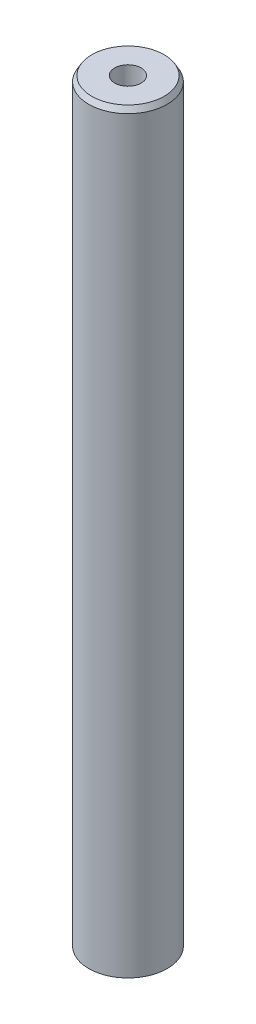
ISO-10303-21;
HEADER;
FILE_DESCRIPTION(('STEP AP214'),'2;1');
FILE_NAME('part.step','',(''),(''),'','','');
FILE_SCHEMA(('AUTOMOTIVE_DESIGN { 1 0 10303 214 1 1 1 1 }'));
ENDSEC;
DATA;
#1=APPLICATION_CONTEXT('core data for automotive mechanical design processes');
#2=APPLICATION_PROTOCOL_DEFINITION('international standard','automotive_design',2000,#1);
#3=PRODUCT_CONTEXT('',#1,'mechanical');
#4=PRODUCT('Part','Part','',(#3));
#5=PRODUCT_RELATED_PRODUCT_CATEGORY('part','',(#4));
#6=PRODUCT_DEFINITION_FORMATION('','',#4);
#7=PRODUCT_DEFINITION_CONTEXT('part definition',#1,'design');
#8=PRODUCT_DEFINITION('design','',#6,#7);
#9=PRODUCT_DEFINITION_SHAPE('','',#8);
#10=(LENGTH_UNIT() NAMED_UNIT(*) SI_UNIT(.MILLI.,.METRE.));
#11=(NAMED_UNIT(*) PLANE_ANGLE_UNIT() SI_UNIT($,.RADIAN.));
#12=(NAMED_UNIT(*) SI_UNIT($,.STERADIAN.) SOLID_ANGLE_UNIT());
#13=UNCERTAINTY_MEASURE_WITH_UNIT(LENGTH_MEASURE(1.E-05),#10,'distance_accuracy_value','');
#14=(GEOMETRIC_REPRESENTATION_CONTEXT(3) GLOBAL_UNCERTAINTY_ASSIGNED_CONTEXT((#13)) GLOBAL_UNIT_ASSIGNED_CONTEXT((#10,
#11,#12)) REPRESENTATION_CONTEXT('',''));
#15=CARTESIAN_POINT('',(0.,0.,0.));
#16=DIRECTION('',(0.,0.,1.));
#17=DIRECTION('',(1.,0.,0.));
#18=AXIS2_PLACEMENT_3D('',#15,#16,#17);
#19=CARTESIAN_POINT('',(0.,241.25524129468,0.));
#20=DIRECTION('',(0.,-1.,0.));
#21=DIRECTION('',(0.,0.,-1.));
#22=AXIS2_PLACEMENT_3D('',#19,#20,#21);
#23=CYLINDRICAL_SURFACE('',#22,12.5);
#24=CARTESIAN_POINT('',(0.,239.54891176798,0.));
#25=DIRECTION('',(0.,1.,0.));
#26=DIRECTION('',(0.,0.,1.));
#27=AXIS2_PLACEMENT_3D('',#24,#25,#26);
#28=CIRCLE('',#27,12.5);
#29=CARTESIAN_POINT('',(0.,239.54891176798,12.5));
#30=VERTEX_POINT('',#29);
#31=EDGE_CURVE('E50',#30,#30,#28,.F.);
#32=ORIENTED_EDGE('',*,*,#31,.T.);
#33=EDGE_LOOP('',(#32));
#34=FACE_BOUND('',#33,.T.);
#35=CARTESIAN_POINT('',(0.,0.985149811566388,0.));
#36=DIRECTION('',(0.,1.,0.));
#37=DIRECTION('',(0.,0.,1.));
#38=AXIS2_PLACEMENT_3D('',#35,#36,#37);
#39=CIRCLE('',#38,12.5);
#40=CARTESIAN_POINT('',(0.,0.985149811566388,12.5));
#41=VERTEX_POINT('',#40);
#42=EDGE_CURVE('E51',#41,#41,#39,.T.);
#43=ORIENTED_EDGE('',*,*,#42,.T.);
#44=EDGE_LOOP('',(#43));
#45=FACE_BOUND('',#44,.T.);
#46=ADVANCED_FACE('F39',(#34,#45),#23,.T.);
#47=CARTESIAN_POINT('',(0.,241.25524129468,0.));
#48=DIRECTION('',(0.,1.,0.));
#49=DIRECTION('',(0.,0.,1.));
#50=AXIS2_PLACEMENT_3D('',#47,#48,#49);
#51=PLANE('',#50);
#52=CARTESIAN_POINT('',(0.,241.25524129468,0.));
#53=DIRECTION('',(0.,1.,0.));
#54=DIRECTION('',(0.,0.,1.));
#55=AXIS2_PLACEMENT_3D('',#52,#53,#54);
#56=CIRCLE('',#55,11.5148501884336);
#57=CARTESIAN_POINT('',(0.,241.25524129468,11.5148501884336));
#58=VERTEX_POINT('',#57);
#59=EDGE_CURVE('E54',#58,#58,#56,.T.);
#60=ORIENTED_EDGE('',*,*,#59,.T.);
#61=EDGE_LOOP('',(#60));
#62=FACE_BOUND('',#61,.T.);
#63=CARTESIAN_POINT('',(0.,241.25524129468,0.));
#64=DIRECTION('',(0.,1.,0.));
#65=DIRECTION('',(0.,0.,1.));
#66=AXIS2_PLACEMENT_3D('',#63,#64,#65);
#67=CIRCLE('',#66,4.20458729804502);
#68=CARTESIAN_POINT('',(0.,241.25524129468,4.20458729804502));
#69=VERTEX_POINT('',#68);
#70=EDGE_CURVE('E58',#69,#69,#67,.T.);
#71=ORIENTED_EDGE('',*,*,#70,.F.);
#72=EDGE_LOOP('',(#71));
#73=FACE_BOUND('',#72,.T.);
#74=ADVANCED_FACE('F69',(#62,#73),#51,.T.);
#75=CARTESIAN_POINT('',(0.,0.,0.));
#76=DIRECTION('',(0.,1.,0.));
#77=DIRECTION('',(0.,0.,1.));
#78=AXIS2_PLACEMENT_3D('',#75,#76,#77);
#79=PLANE('',#78);
#80=CARTESIAN_POINT('',(0.,0.,0.));
#81=DIRECTION('',(0.,1.,0.));
#82=DIRECTION('',(0.,0.,1.));
#83=AXIS2_PLACEMENT_3D('',#80,#81,#82);
#84=CIRCLE('',#83,10.7936704733001);
#85=CARTESIAN_POINT('',(0.,0.,10.7936704733001));
#86=VERTEX_POINT('',#85);
#87=EDGE_CURVE('E10',#86,#86,#84,.F.);
#88=ORIENTED_EDGE('',*,*,#87,.T.);
#89=EDGE_LOOP('',(#88));
#90=FACE_BOUND('',#89,.T.);
#91=CARTESIAN_POINT('',(0.,0.,0.));
#92=DIRECTION('',(0.,1.,0.));
#93=DIRECTION('',(0.,0.,1.));
#94=AXIS2_PLACEMENT_3D('',#91,#92,#93);
#95=CIRCLE('',#94,4.20458729804502);
#96=CARTESIAN_POINT('',(0.,0.,4.20458729804502));
#97=VERTEX_POINT('',#96);
#98=EDGE_CURVE('E63',#97,#97,#95,.T.);
#99=ORIENTED_EDGE('',*,*,#98,.T.);
#100=EDGE_LOOP('',(#99));
#101=FACE_BOUND('',#100,.T.);
#102=ADVANCED_FACE('F75',(#90,#101),#79,.F.);
#103=CARTESIAN_POINT('',(0.,241.25524129468,0.));
#104=DIRECTION('',(0.,-1.,0.));
#105=DIRECTION('',(0.,0.,-1.));
#106=AXIS2_PLACEMENT_3D('',#103,#104,#105);
#107=CYLINDRICAL_SURFACE('',#106,4.20458729804502);
#108=ORIENTED_EDGE('',*,*,#70,.T.);
#109=EDGE_LOOP('',(#108));
#110=FACE_BOUND('',#109,.T.);
#111=ORIENTED_EDGE('',*,*,#98,.F.);
#112=EDGE_LOOP('',(#111));
#113=FACE_BOUND('',#112,.T.);
#114=ADVANCED_FACE('F70',(#110,#113),#107,.F.);
#115=CARTESIAN_POINT('',(0.,241.25524129468,0.));
#116=DIRECTION('',(0.,-1.,0.));
#117=DIRECTION('',(0.,0.,-1.));
#118=AXIS2_PLACEMENT_3D('',#115,#116,#117);
#119=CONICAL_SURFACE('',#118,11.5148501884336,0.523598775598294);
#120=ORIENTED_EDGE('',*,*,#31,.F.);
#121=EDGE_LOOP('',(#120));
#122=FACE_BOUND('',#121,.T.);
#123=ORIENTED_EDGE('',*,*,#59,.F.);
#124=EDGE_LOOP('',(#123));
#125=FACE_BOUND('',#124,.T.);
#126=ADVANCED_FACE('F81',(#122,#125),#119,.T.);
#127=CARTESIAN_POINT('',(0.,0.985149811566388,0.));
#128=DIRECTION('',(0.,1.,0.));
#129=DIRECTION('',(0.,0.,1.));
#130=AXIS2_PLACEMENT_3D('',#127,#128,#129);
#131=CONICAL_SURFACE('',#130,12.5,1.0471975511966);
#132=ORIENTED_EDGE('',*,*,#87,.F.);
#133=EDGE_LOOP('',(#132));
#134=FACE_BOUND('',#133,.T.);
#135=ORIENTED_EDGE('',*,*,#42,.F.);
#136=EDGE_LOOP('',(#135));
#137=FACE_BOUND('',#136,.T.);
#138=ADVANCED_FACE('F45',(#134,#137),#131,.T.);
#139=CLOSED_SHELL('',(#46,#74,#102,#114,#126,#138));
#140=MANIFOLD_SOLID_BREP('B2',#139);
#141=ADVANCED_BREP_SHAPE_REPRESENTATION('',(#18,#140),#14);
#142=SHAPE_DEFINITION_REPRESENTATION(#9,#141);
ENDSEC;
END-ISO-10303-21;
